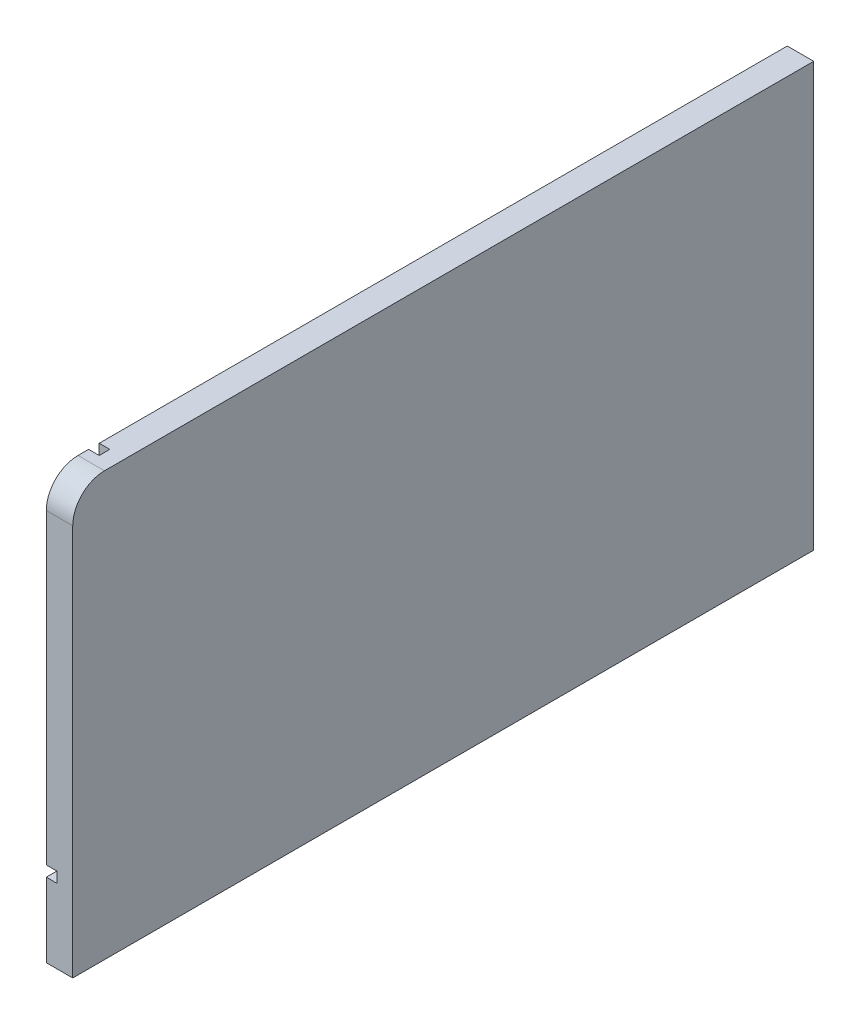
ISO-10303-21;
HEADER;
FILE_DESCRIPTION(('STEP AP214'),'2;1');
FILE_NAME('part.step','',(''),(''),'','','');
FILE_SCHEMA(('AUTOMOTIVE_DESIGN { 1 0 10303 214 1 1 1 1 }'));
ENDSEC;
DATA;
#1=APPLICATION_CONTEXT('core data for automotive mechanical design processes');
#2=APPLICATION_PROTOCOL_DEFINITION('international standard','automotive_design',2000,#1);
#3=PRODUCT_CONTEXT('',#1,'mechanical');
#4=PRODUCT('Part','Part','',(#3));
#5=PRODUCT_RELATED_PRODUCT_CATEGORY('part','',(#4));
#6=PRODUCT_DEFINITION_FORMATION('','',#4);
#7=PRODUCT_DEFINITION_CONTEXT('part definition',#1,'design');
#8=PRODUCT_DEFINITION('design','',#6,#7);
#9=PRODUCT_DEFINITION_SHAPE('','',#8);
#10=(LENGTH_UNIT() NAMED_UNIT(*) SI_UNIT(.MILLI.,.METRE.));
#11=(NAMED_UNIT(*) PLANE_ANGLE_UNIT() SI_UNIT($,.RADIAN.));
#12=(NAMED_UNIT(*) SI_UNIT($,.STERADIAN.) SOLID_ANGLE_UNIT());
#13=UNCERTAINTY_MEASURE_WITH_UNIT(LENGTH_MEASURE(1.E-05),#10,'distance_accuracy_value','');
#14=(GEOMETRIC_REPRESENTATION_CONTEXT(3) GLOBAL_UNCERTAINTY_ASSIGNED_CONTEXT((#13)) GLOBAL_UNIT_ASSIGNED_CONTEXT((#10,
#11,#12)) REPRESENTATION_CONTEXT('',''));
#15=CARTESIAN_POINT('',(0.,0.,0.));
#16=DIRECTION('',(0.,0.,1.));
#17=DIRECTION('',(1.,0.,0.));
#18=AXIS2_PLACEMENT_3D('',#15,#16,#17);
#19=CARTESIAN_POINT('',(0.,234.95,-19.05));
#20=DIRECTION('',(-1.,0.,0.));
#21=DIRECTION('',(0.,0.,1.));
#22=AXIS2_PLACEMENT_3D('',#19,#20,#21);
#23=PLANE('',#22);
#24=DIRECTION('',(0.,1.,0.));
#25=VECTOR('',#24,1.);
#26=CARTESIAN_POINT('',(0.,-0.000999999999973245,-25.4));
#27=LINE('',#26,#25);
#28=CARTESIAN_POINT('',(0.,50.8,-25.4));
#29=VERTEX_POINT('',#28);
#30=CARTESIAN_POINT('',(0.,254.,-25.4));
#31=VERTEX_POINT('',#30);
#32=EDGE_CURVE('E280',#29,#31,#27,.T.);
#33=ORIENTED_EDGE('',*,*,#32,.F.);
#34=DIRECTION('',(0.,0.,-1.));
#35=VECTOR('',#34,1.);
#36=CARTESIAN_POINT('',(0.,50.8,0.));
#37=LINE('',#36,#35);
#38=CARTESIAN_POINT('',(0.,50.8,0.));
#39=VERTEX_POINT('',#38);
#40=EDGE_CURVE('E174',#39,#29,#37,.T.);
#41=ORIENTED_EDGE('',*,*,#40,.F.);
#42=DIRECTION('',(0.,-1.,0.));
#43=VECTOR('',#42,1.);
#44=CARTESIAN_POINT('',(0.,0.,0.));
#45=LINE('',#44,#43);
#46=CARTESIAN_POINT('',(0.,234.95,0.));
#47=VERTEX_POINT('',#46);
#48=EDGE_CURVE('E198',#47,#39,#45,.T.);
#49=ORIENTED_EDGE('',*,*,#48,.F.);
#50=CARTESIAN_POINT('',(0.,234.95,-19.05));
#51=DIRECTION('',(1.,0.,0.));
#52=DIRECTION('',(0.,0.,1.));
#53=AXIS2_PLACEMENT_3D('',#50,#51,#52);
#54=CIRCLE('',#53,19.05);
#55=CARTESIAN_POINT('',(0.,254.,-19.05));
#56=VERTEX_POINT('',#55);
#57=EDGE_CURVE('E189',#56,#47,#54,.T.);
#58=ORIENTED_EDGE('',*,*,#57,.F.);
#59=DIRECTION('',(0.,0.,1.));
#60=VECTOR('',#59,1.);
#61=CARTESIAN_POINT('',(0.,254.,-19.05));
#62=LINE('',#61,#60);
#63=EDGE_CURVE('E210',#31,#56,#62,.T.);
#64=ORIENTED_EDGE('',*,*,#63,.F.);
#65=EDGE_LOOP('',(#33,#41,#49,#58,#64));
#66=FACE_BOUND('',#65,.T.);
#67=ADVANCED_FACE('F33',(#66),#23,.T.);
#68=CARTESIAN_POINT('',(0.,50.8,0.));
#69=DIRECTION('',(0.,1.,0.));
#70=DIRECTION('',(0.,0.,1.));
#71=AXIS2_PLACEMENT_3D('',#68,#69,#70);
#72=PLANE('',#71);
#73=ORIENTED_EDGE('',*,*,#40,.T.);
#74=DIRECTION('',(-1.,0.,0.));
#75=VECTOR('',#74,1.);
#76=CARTESIAN_POINT('',(0.,50.8,-25.4));
#77=LINE('',#76,#75);
#78=CARTESIAN_POINT('',(6.35,50.8,-25.4));
#79=VERTEX_POINT('',#78);
#80=EDGE_CURVE('E167',#79,#29,#77,.T.);
#81=ORIENTED_EDGE('',*,*,#80,.F.);
#82=DIRECTION('',(0.,0.,-1.));
#83=VECTOR('',#82,1.);
#84=CARTESIAN_POINT('',(6.35,50.8,0.));
#85=LINE('',#84,#83);
#86=CARTESIAN_POINT('',(6.35,50.8,0.));
#87=VERTEX_POINT('',#86);
#88=EDGE_CURVE('E173',#87,#79,#85,.T.);
#89=ORIENTED_EDGE('',*,*,#88,.F.);
#90=DIRECTION('',(1.,0.,0.));
#91=VECTOR('',#90,1.);
#92=CARTESIAN_POINT('',(0.,50.8,0.));
#93=LINE('',#92,#91);
#94=EDGE_CURVE('E245',#39,#87,#93,.T.);
#95=ORIENTED_EDGE('',*,*,#94,.F.);
#96=EDGE_LOOP('',(#73,#81,#89,#95));
#97=FACE_BOUND('',#96,.T.);
#98=ADVANCED_FACE('F283',(#97),#72,.F.);
#99=DIRECTION('',(0.,-1.,0.));
#100=VECTOR('',#99,1.);
#101=CARTESIAN_POINT('',(0.,254.001,-6.35));
#102=LINE('',#101,#100);
#103=CARTESIAN_POINT('',(0.,44.45,-6.35));
#104=VERTEX_POINT('',#103);
#105=CARTESIAN_POINT('',(0.,0.,-6.35));
#106=VERTEX_POINT('',#105);
#107=EDGE_CURVE('E266',#104,#106,#102,.T.);
#108=ORIENTED_EDGE('',*,*,#107,.T.);
#109=DIRECTION('',(0.,0.,-1.));
#110=VECTOR('',#109,1.);
#111=CARTESIAN_POINT('',(0.,0.,0.));
#112=LINE('',#111,#110);
#113=CARTESIAN_POINT('',(0.,0.,0.));
#114=VERTEX_POINT('',#113);
#115=EDGE_CURVE('E203',#114,#106,#112,.T.);
#116=ORIENTED_EDGE('',*,*,#115,.F.);
#117=CARTESIAN_POINT('',(0.,44.45,0.));
#118=VERTEX_POINT('',#117);
#119=EDGE_CURVE('E202',#118,#114,#45,.T.);
#120=ORIENTED_EDGE('',*,*,#119,.F.);
#121=DIRECTION('',(0.,0.,-1.));
#122=VECTOR('',#121,1.);
#123=CARTESIAN_POINT('',(0.,44.45,0.));
#124=LINE('',#123,#122);
#125=EDGE_CURVE('E241',#118,#104,#124,.T.);
#126=ORIENTED_EDGE('',*,*,#125,.T.);
#127=EDGE_LOOP('',(#108,#116,#120,#126));
#128=FACE_BOUND('',#127,.T.);
#129=ADVANCED_FACE('F265',(#128),#23,.T.);
#130=CARTESIAN_POINT('',(0.,44.45,0.));
#131=DIRECTION('',(0.,-1.,0.));
#132=DIRECTION('',(0.,0.,-1.));
#133=AXIS2_PLACEMENT_3D('',#130,#131,#132);
#134=PLANE('',#133);
#135=DIRECTION('',(0.,0.,-1.));
#136=VECTOR('',#135,1.);
#137=CARTESIAN_POINT('',(6.35,44.45,0.));
#138=LINE('',#137,#136);
#139=CARTESIAN_POINT('',(6.35,44.45,0.));
#140=VERTEX_POINT('',#139);
#141=CARTESIAN_POINT('',(6.35,44.45,-6.35));
#142=VERTEX_POINT('',#141);
#143=EDGE_CURVE('E182',#140,#142,#138,.T.);
#144=ORIENTED_EDGE('',*,*,#143,.T.);
#145=DIRECTION('',(1.,0.,0.));
#146=VECTOR('',#145,1.);
#147=CARTESIAN_POINT('',(0.,44.45,-6.35));
#148=LINE('',#147,#146);
#149=EDGE_CURVE('E56',#104,#142,#148,.T.);
#150=ORIENTED_EDGE('',*,*,#149,.F.);
#151=ORIENTED_EDGE('',*,*,#125,.F.);
#152=DIRECTION('',(-1.,0.,0.));
#153=VECTOR('',#152,1.);
#154=CARTESIAN_POINT('',(0.,44.45,0.));
#155=LINE('',#154,#153);
#156=EDGE_CURVE('E264',#140,#118,#155,.T.);
#157=ORIENTED_EDGE('',*,*,#156,.F.);
#158=EDGE_LOOP('',(#144,#150,#151,#157));
#159=FACE_BOUND('',#158,.T.);
#160=ADVANCED_FACE('F326',(#159),#134,.F.);
#161=DIRECTION('',(0.,-1.,0.));
#162=VECTOR('',#161,1.);
#163=CARTESIAN_POINT('',(0.,254.001,-12.7));
#164=LINE('',#163,#162);
#165=CARTESIAN_POINT('',(0.,44.45,-12.7));
#166=VERTEX_POINT('',#165);
#167=CARTESIAN_POINT('',(0.,0.,-12.7));
#168=VERTEX_POINT('',#167);
#169=EDGE_CURVE('E238',#166,#168,#164,.T.);
#170=ORIENTED_EDGE('',*,*,#169,.F.);
#171=CARTESIAN_POINT('',(0.,44.45,-444.5));
#172=VERTEX_POINT('',#171);
#173=EDGE_CURVE('E236',#166,#172,#124,.T.);
#174=ORIENTED_EDGE('',*,*,#173,.T.);
#175=DIRECTION('',(0.,1.,0.));
#176=VECTOR('',#175,1.);
#177=CARTESIAN_POINT('',(0.,0.,-444.5));
#178=LINE('',#177,#176);
#179=CARTESIAN_POINT('',(0.,0.,-444.5));
#180=VERTEX_POINT('',#179);
#181=EDGE_CURVE('E207',#180,#172,#178,.T.);
#182=ORIENTED_EDGE('',*,*,#181,.F.);
#183=EDGE_CURVE('E201',#168,#180,#112,.T.);
#184=ORIENTED_EDGE('',*,*,#183,.F.);
#185=EDGE_LOOP('',(#170,#174,#182,#184));
#186=FACE_BOUND('',#185,.T.);
#187=ADVANCED_FACE('F234',(#186),#23,.T.);
#188=CARTESIAN_POINT('',(15.875,0.,0.));
#189=DIRECTION('',(0.,0.,-1.));
#190=DIRECTION('',(-1.,0.,0.));
#191=AXIS2_PLACEMENT_3D('',#188,#189,#190);
#192=PLANE('',#191);
#193=DIRECTION('',(0.,-1.,0.));
#194=VECTOR('',#193,1.);
#195=CARTESIAN_POINT('',(6.35,50.8,0.));
#196=LINE('',#195,#194);
#197=EDGE_CURVE('E249',#87,#140,#196,.T.);
#198=ORIENTED_EDGE('',*,*,#197,.T.);
#199=ORIENTED_EDGE('',*,*,#156,.T.);
#200=ORIENTED_EDGE('',*,*,#119,.T.);
#201=DIRECTION('',(-1.,0.,0.));
#202=VECTOR('',#201,1.);
#203=CARTESIAN_POINT('',(15.875,0.,0.));
#204=LINE('',#203,#202);
#205=CARTESIAN_POINT('',(15.875,0.,0.));
#206=VERTEX_POINT('',#205);
#207=EDGE_CURVE('E11',#206,#114,#204,.T.);
#208=ORIENTED_EDGE('',*,*,#207,.F.);
#209=DIRECTION('',(0.,-1.,0.));
#210=VECTOR('',#209,1.);
#211=CARTESIAN_POINT('',(15.875,0.,0.));
#212=LINE('',#211,#210);
#213=CARTESIAN_POINT('',(15.875,234.95,0.));
#214=VERTEX_POINT('',#213);
#215=EDGE_CURVE('E185',#214,#206,#212,.T.);
#216=ORIENTED_EDGE('',*,*,#215,.F.);
#217=DIRECTION('',(-1.,0.,0.));
#218=VECTOR('',#217,1.);
#219=CARTESIAN_POINT('',(15.875,234.95,0.));
#220=LINE('',#219,#218);
#221=EDGE_CURVE('E197',#214,#47,#220,.T.);
#222=ORIENTED_EDGE('',*,*,#221,.T.);
#223=ORIENTED_EDGE('',*,*,#48,.T.);
#224=ORIENTED_EDGE('',*,*,#94,.T.);
#225=EDGE_LOOP('',(#198,#199,#200,#208,#216,#222,#223,#224));
#226=FACE_BOUND('',#225,.T.);
#227=ADVANCED_FACE('F35',(#226),#192,.F.);
#228=CARTESIAN_POINT('',(15.875,0.,0.));
#229=DIRECTION('',(0.,1.,0.));
#230=DIRECTION('',(0.,0.,1.));
#231=AXIS2_PLACEMENT_3D('',#228,#229,#230);
#232=PLANE('',#231);
#233=ORIENTED_EDGE('',*,*,#115,.T.);
#234=DIRECTION('',(-1.,0.,0.));
#235=VECTOR('',#234,1.);
#236=CARTESIAN_POINT('',(0.,0.,-6.35));
#237=LINE('',#236,#235);
#238=CARTESIAN_POINT('',(6.35,0.,-6.35));
#239=VERTEX_POINT('',#238);
#240=EDGE_CURVE('E295',#239,#106,#237,.T.);
#241=ORIENTED_EDGE('',*,*,#240,.F.);
#242=DIRECTION('',(0.,0.,1.));
#243=VECTOR('',#242,1.);
#244=CARTESIAN_POINT('',(6.35,0.,-6.35));
#245=LINE('',#244,#243);
#246=CARTESIAN_POINT('',(6.35,0.,-12.7));
#247=VERTEX_POINT('',#246);
#248=EDGE_CURVE('E299',#247,#239,#245,.T.);
#249=ORIENTED_EDGE('',*,*,#248,.F.);
#250=DIRECTION('',(1.,0.,0.));
#251=VECTOR('',#250,1.);
#252=CARTESIAN_POINT('',(0.,0.,-12.7));
#253=LINE('',#252,#251);
#254=EDGE_CURVE('E302',#168,#247,#253,.T.);
#255=ORIENTED_EDGE('',*,*,#254,.F.);
#256=ORIENTED_EDGE('',*,*,#183,.T.);
#257=DIRECTION('',(-1.,0.,0.));
#258=VECTOR('',#257,1.);
#259=CARTESIAN_POINT('',(15.875,0.,-444.5));
#260=LINE('',#259,#258);
#261=CARTESIAN_POINT('',(15.875,0.,-444.5));
#262=VERTEX_POINT('',#261);
#263=EDGE_CURVE('E41',#262,#180,#260,.T.);
#264=ORIENTED_EDGE('',*,*,#263,.F.);
#265=DIRECTION('',(0.,0.,-1.));
#266=VECTOR('',#265,1.);
#267=CARTESIAN_POINT('',(15.875,0.,0.));
#268=LINE('',#267,#266);
#269=EDGE_CURVE('E188',#206,#262,#268,.T.);
#270=ORIENTED_EDGE('',*,*,#269,.F.);
#271=ORIENTED_EDGE('',*,*,#207,.T.);
#272=EDGE_LOOP('',(#233,#241,#249,#255,#256,#264,#270,#271));
#273=FACE_BOUND('',#272,.T.);
#274=ADVANCED_FACE('F268',(#273),#232,.F.);
#275=CARTESIAN_POINT('',(15.875,0.,-444.5));
#276=DIRECTION('',(0.,0.,1.));
#277=DIRECTION('',(1.,0.,0.));
#278=AXIS2_PLACEMENT_3D('',#275,#276,#277);
#279=PLANE('',#278);
#280=ORIENTED_EDGE('',*,*,#181,.T.);
#281=DIRECTION('',(-1.,0.,0.));
#282=VECTOR('',#281,1.);
#283=CARTESIAN_POINT('',(0.,44.45,-444.5));
#284=LINE('',#283,#282);
#285=CARTESIAN_POINT('',(6.35,44.45,-444.5));
#286=VERTEX_POINT('',#285);
#287=EDGE_CURVE('E242',#286,#172,#284,.T.);
#288=ORIENTED_EDGE('',*,*,#287,.F.);
#289=DIRECTION('',(0.,-1.,0.));
#290=VECTOR('',#289,1.);
#291=CARTESIAN_POINT('',(6.35,50.8,-444.5));
#292=LINE('',#291,#290);
#293=CARTESIAN_POINT('',(6.35,50.8,-444.5));
#294=VERTEX_POINT('',#293);
#295=EDGE_CURVE('E246',#294,#286,#292,.T.);
#296=ORIENTED_EDGE('',*,*,#295,.F.);
#297=DIRECTION('',(1.,0.,0.));
#298=VECTOR('',#297,1.);
#299=CARTESIAN_POINT('',(0.,50.8,-444.5));
#300=LINE('',#299,#298);
#301=CARTESIAN_POINT('',(0.,50.8,-444.5));
#302=VERTEX_POINT('',#301);
#303=EDGE_CURVE('E171',#302,#294,#300,.T.);
#304=ORIENTED_EDGE('',*,*,#303,.F.);
#305=CARTESIAN_POINT('',(0.,254.,-444.5));
#306=VERTEX_POINT('',#305);
#307=EDGE_CURVE('E206',#302,#306,#178,.T.);
#308=ORIENTED_EDGE('',*,*,#307,.T.);
#309=DIRECTION('',(-1.,0.,0.));
#310=VECTOR('',#309,1.);
#311=CARTESIAN_POINT('',(15.875,254.,-444.5));
#312=LINE('',#311,#310);
#313=CARTESIAN_POINT('',(15.875,254.,-444.5));
#314=VERTEX_POINT('',#313);
#315=EDGE_CURVE('E220',#314,#306,#312,.T.);
#316=ORIENTED_EDGE('',*,*,#315,.F.);
#317=DIRECTION('',(0.,1.,0.));
#318=VECTOR('',#317,1.);
#319=CARTESIAN_POINT('',(15.875,0.,-444.5));
#320=LINE('',#319,#318);
#321=EDGE_CURVE('E191',#262,#314,#320,.T.);
#322=ORIENTED_EDGE('',*,*,#321,.F.);
#323=ORIENTED_EDGE('',*,*,#263,.T.);
#324=EDGE_LOOP('',(#280,#288,#296,#304,#308,#316,#322,#323));
#325=FACE_BOUND('',#324,.T.);
#326=ADVANCED_FACE('F227',(#325),#279,.F.);
#327=CARTESIAN_POINT('',(15.875,254.,-19.05));
#328=DIRECTION('',(0.,-1.,0.));
#329=DIRECTION('',(0.,0.,-1.));
#330=AXIS2_PLACEMENT_3D('',#327,#328,#329);
#331=PLANE('',#330);
#332=DIRECTION('',(0.,0.,-1.));
#333=VECTOR('',#332,1.);
#334=CARTESIAN_POINT('',(6.35,254.,-25.4));
#335=LINE('',#334,#333);
#336=CARTESIAN_POINT('',(6.35,254.,-25.4));
#337=VERTEX_POINT('',#336);
#338=CARTESIAN_POINT('',(6.35,254.,-31.75));
#339=VERTEX_POINT('',#338);
#340=EDGE_CURVE('E159',#337,#339,#335,.T.);
#341=ORIENTED_EDGE('',*,*,#340,.F.);
#342=DIRECTION('',(1.,0.,0.));
#343=VECTOR('',#342,1.);
#344=CARTESIAN_POINT('',(0.,254.,-25.4));
#345=LINE('',#344,#343);
#346=EDGE_CURVE('E310',#31,#337,#345,.T.);
#347=ORIENTED_EDGE('',*,*,#346,.F.);
#348=ORIENTED_EDGE('',*,*,#63,.T.);
#349=DIRECTION('',(-1.,0.,0.));
#350=VECTOR('',#349,1.);
#351=CARTESIAN_POINT('',(15.875,254.,-19.05));
#352=LINE('',#351,#350);
#353=CARTESIAN_POINT('',(15.875,254.,-19.05));
#354=VERTEX_POINT('',#353);
#355=EDGE_CURVE('E217',#354,#56,#352,.T.);
#356=ORIENTED_EDGE('',*,*,#355,.F.);
#357=DIRECTION('',(0.,0.,1.));
#358=VECTOR('',#357,1.);
#359=CARTESIAN_POINT('',(15.875,254.,-19.05));
#360=LINE('',#359,#358);
#361=EDGE_CURVE('E193',#314,#354,#360,.T.);
#362=ORIENTED_EDGE('',*,*,#361,.F.);
#363=ORIENTED_EDGE('',*,*,#315,.T.);
#364=CARTESIAN_POINT('',(0.,254.,-31.75));
#365=VERTEX_POINT('',#364);
#366=EDGE_CURVE('E211',#306,#365,#62,.T.);
#367=ORIENTED_EDGE('',*,*,#366,.T.);
#368=DIRECTION('',(-1.,0.,0.));
#369=VECTOR('',#368,1.);
#370=CARTESIAN_POINT('',(0.,254.,-31.75));
#371=LINE('',#370,#369);
#372=EDGE_CURVE('E307',#339,#365,#371,.T.);
#373=ORIENTED_EDGE('',*,*,#372,.F.);
#374=EDGE_LOOP('',(#341,#347,#348,#356,#362,#363,#367,#373));
#375=FACE_BOUND('',#374,.T.);
#376=ADVANCED_FACE('F319',(#375),#331,.F.);
#377=CARTESIAN_POINT('',(15.875,234.95,-19.05));
#378=DIRECTION('',(-1.,0.,0.));
#379=DIRECTION('',(0.,0.,1.));
#380=AXIS2_PLACEMENT_3D('',#377,#378,#379);
#381=CYLINDRICAL_SURFACE('',#380,19.05);
#382=ORIENTED_EDGE('',*,*,#57,.T.);
#383=ORIENTED_EDGE('',*,*,#221,.F.);
#384=CARTESIAN_POINT('',(15.875,234.95,-19.05));
#385=DIRECTION('',(1.,0.,0.));
#386=DIRECTION('',(0.,0.,1.));
#387=AXIS2_PLACEMENT_3D('',#384,#385,#386);
#388=CIRCLE('',#387,19.05);
#389=EDGE_CURVE('E195',#354,#214,#388,.T.);
#390=ORIENTED_EDGE('',*,*,#389,.F.);
#391=ORIENTED_EDGE('',*,*,#355,.T.);
#392=EDGE_LOOP('',(#382,#383,#390,#391));
#393=FACE_BOUND('',#392,.T.);
#394=ADVANCED_FACE('F354',(#393),#381,.T.);
#395=CARTESIAN_POINT('',(15.875,234.95,-19.05));
#396=DIRECTION('',(-1.,0.,0.));
#397=DIRECTION('',(0.,0.,1.));
#398=AXIS2_PLACEMENT_3D('',#395,#396,#397);
#399=PLANE('',#398);
#400=ORIENTED_EDGE('',*,*,#215,.T.);
#401=ORIENTED_EDGE('',*,*,#269,.T.);
#402=ORIENTED_EDGE('',*,*,#321,.T.);
#403=ORIENTED_EDGE('',*,*,#361,.T.);
#404=ORIENTED_EDGE('',*,*,#389,.T.);
#405=EDGE_LOOP('',(#400,#401,#402,#403,#404));
#406=FACE_BOUND('',#405,.T.);
#407=ADVANCED_FACE('F270',(#406),#399,.F.);
#408=DIRECTION('',(0.,1.,0.));
#409=VECTOR('',#408,1.);
#410=CARTESIAN_POINT('',(0.,-0.000999999999973245,-31.75));
#411=LINE('',#410,#409);
#412=CARTESIAN_POINT('',(0.,50.8,-31.75));
#413=VERTEX_POINT('',#412);
#414=EDGE_CURVE('E48',#413,#365,#411,.T.);
#415=ORIENTED_EDGE('',*,*,#414,.T.);
#416=ORIENTED_EDGE('',*,*,#366,.F.);
#417=ORIENTED_EDGE('',*,*,#307,.F.);
#418=EDGE_CURVE('E179',#413,#302,#37,.T.);
#419=ORIENTED_EDGE('',*,*,#418,.F.);
#420=EDGE_LOOP('',(#415,#416,#417,#419));
#421=FACE_BOUND('',#420,.T.);
#422=ADVANCED_FACE('F322',(#421),#23,.T.);
#423=ORIENTED_EDGE('',*,*,#173,.F.);
#424=DIRECTION('',(-1.,0.,0.));
#425=VECTOR('',#424,1.);
#426=CARTESIAN_POINT('',(0.,44.45,-12.7));
#427=LINE('',#426,#425);
#428=CARTESIAN_POINT('',(6.35,44.45,-12.7));
#429=VERTEX_POINT('',#428);
#430=EDGE_CURVE('E288',#429,#166,#427,.T.);
#431=ORIENTED_EDGE('',*,*,#430,.F.);
#432=EDGE_CURVE('E177',#429,#286,#138,.T.);
#433=ORIENTED_EDGE('',*,*,#432,.T.);
#434=ORIENTED_EDGE('',*,*,#287,.T.);
#435=EDGE_LOOP('',(#423,#431,#433,#434));
#436=FACE_BOUND('',#435,.T.);
#437=ADVANCED_FACE('F243',(#436),#134,.F.);
#438=CARTESIAN_POINT('',(6.35,50.8,0.));
#439=DIRECTION('',(1.,0.,0.));
#440=DIRECTION('',(0.,1.,0.));
#441=AXIS2_PLACEMENT_3D('',#438,#439,#440);
#442=PLANE('',#441);
#443=ORIENTED_EDGE('',*,*,#295,.T.);
#444=ORIENTED_EDGE('',*,*,#432,.F.);
#445=DIRECTION('',(0.,-1.,0.));
#446=VECTOR('',#445,1.);
#447=CARTESIAN_POINT('',(6.35,254.001,-12.7));
#448=LINE('',#447,#446);
#449=EDGE_CURVE('E294',#429,#247,#448,.T.);
#450=ORIENTED_EDGE('',*,*,#449,.T.);
#451=ORIENTED_EDGE('',*,*,#248,.T.);
#452=DIRECTION('',(0.,-1.,0.));
#453=VECTOR('',#452,1.);
#454=CARTESIAN_POINT('',(6.35,254.001,-6.35));
#455=LINE('',#454,#453);
#456=EDGE_CURVE('E290',#142,#239,#455,.T.);
#457=ORIENTED_EDGE('',*,*,#456,.F.);
#458=ORIENTED_EDGE('',*,*,#143,.F.);
#459=ORIENTED_EDGE('',*,*,#197,.F.);
#460=ORIENTED_EDGE('',*,*,#88,.T.);
#461=DIRECTION('',(0.,1.,0.));
#462=VECTOR('',#461,1.);
#463=CARTESIAN_POINT('',(6.35,-0.000999999999973245,-25.4));
#464=LINE('',#463,#462);
#465=EDGE_CURVE('E161',#79,#337,#464,.T.);
#466=ORIENTED_EDGE('',*,*,#465,.T.);
#467=ORIENTED_EDGE('',*,*,#340,.T.);
#468=DIRECTION('',(0.,1.,0.));
#469=VECTOR('',#468,1.);
#470=CARTESIAN_POINT('',(6.35,-0.000999999999973245,-31.75));
#471=LINE('',#470,#469);
#472=CARTESIAN_POINT('',(6.35,50.8,-31.75));
#473=VERTEX_POINT('',#472);
#474=EDGE_CURVE('E152',#473,#339,#471,.T.);
#475=ORIENTED_EDGE('',*,*,#474,.F.);
#476=EDGE_CURVE('E156',#473,#294,#85,.T.);
#477=ORIENTED_EDGE('',*,*,#476,.T.);
#478=EDGE_LOOP('',(#443,#444,#450,#451,#457,#458,#459,#460,#466,#467,#475,#477));
#479=FACE_BOUND('',#478,.T.);
#480=ADVANCED_FACE('F154',(#479),#442,.F.);
#481=ORIENTED_EDGE('',*,*,#476,.F.);
#482=DIRECTION('',(1.,0.,0.));
#483=VECTOR('',#482,1.);
#484=CARTESIAN_POINT('',(0.,50.8,-31.75));
#485=LINE('',#484,#483);
#486=EDGE_CURVE('E163',#413,#473,#485,.T.);
#487=ORIENTED_EDGE('',*,*,#486,.F.);
#488=ORIENTED_EDGE('',*,*,#418,.T.);
#489=ORIENTED_EDGE('',*,*,#303,.T.);
#490=EDGE_LOOP('',(#481,#487,#488,#489));
#491=FACE_BOUND('',#490,.T.);
#492=ADVANCED_FACE('F169',(#491),#72,.F.);
#493=CARTESIAN_POINT('',(0.,254.001,-6.35));
#494=DIRECTION('',(0.,0.,1.));
#495=DIRECTION('',(1.,0.,0.));
#496=AXIS2_PLACEMENT_3D('',#493,#494,#495);
#497=PLANE('',#496);
#498=ORIENTED_EDGE('',*,*,#149,.T.);
#499=ORIENTED_EDGE('',*,*,#456,.T.);
#500=ORIENTED_EDGE('',*,*,#240,.T.);
#501=ORIENTED_EDGE('',*,*,#107,.F.);
#502=EDGE_LOOP('',(#498,#499,#500,#501));
#503=FACE_BOUND('',#502,.T.);
#504=ADVANCED_FACE('F328',(#503),#497,.F.);
#505=CARTESIAN_POINT('',(0.,254.001,-12.7));
#506=DIRECTION('',(0.,0.,-1.));
#507=DIRECTION('',(-1.,0.,0.));
#508=AXIS2_PLACEMENT_3D('',#505,#506,#507);
#509=PLANE('',#508);
#510=ORIENTED_EDGE('',*,*,#430,.T.);
#511=ORIENTED_EDGE('',*,*,#169,.T.);
#512=ORIENTED_EDGE('',*,*,#254,.T.);
#513=ORIENTED_EDGE('',*,*,#449,.F.);
#514=EDGE_LOOP('',(#510,#511,#512,#513));
#515=FACE_BOUND('',#514,.T.);
#516=ADVANCED_FACE('F330',(#515),#509,.F.);
#517=CARTESIAN_POINT('',(0.,-0.000999999999973245,-25.4));
#518=DIRECTION('',(0.,0.,1.));
#519=DIRECTION('',(1.,0.,0.));
#520=AXIS2_PLACEMENT_3D('',#517,#518,#519);
#521=PLANE('',#520);
#522=ORIENTED_EDGE('',*,*,#80,.T.);
#523=ORIENTED_EDGE('',*,*,#32,.T.);
#524=ORIENTED_EDGE('',*,*,#346,.T.);
#525=ORIENTED_EDGE('',*,*,#465,.F.);
#526=EDGE_LOOP('',(#522,#523,#524,#525));
#527=FACE_BOUND('',#526,.T.);
#528=ADVANCED_FACE('F316',(#527),#521,.F.);
#529=CARTESIAN_POINT('',(0.,-0.000999999999973245,-31.75));
#530=DIRECTION('',(0.,0.,-1.));
#531=DIRECTION('',(-1.,0.,0.));
#532=AXIS2_PLACEMENT_3D('',#529,#530,#531);
#533=PLANE('',#532);
#534=ORIENTED_EDGE('',*,*,#486,.T.);
#535=ORIENTED_EDGE('',*,*,#474,.T.);
#536=ORIENTED_EDGE('',*,*,#372,.T.);
#537=ORIENTED_EDGE('',*,*,#414,.F.);
#538=EDGE_LOOP('',(#534,#535,#536,#537));
#539=FACE_BOUND('',#538,.T.);
#540=ADVANCED_FACE('F164',(#539),#533,.F.);
#541=CLOSED_SHELL('',(#67,#98,#129,#160,#187,#227,#274,#326,#376,#394,#407,#422,#437,#480,#492,
#504,#516,#528,#540));
#542=MANIFOLD_SOLID_BREP('B2',#541);
#543=ADVANCED_BREP_SHAPE_REPRESENTATION('',(#18,#542),#14);
#544=SHAPE_DEFINITION_REPRESENTATION(#9,#543);
ENDSEC;
END-ISO-10303-21;
